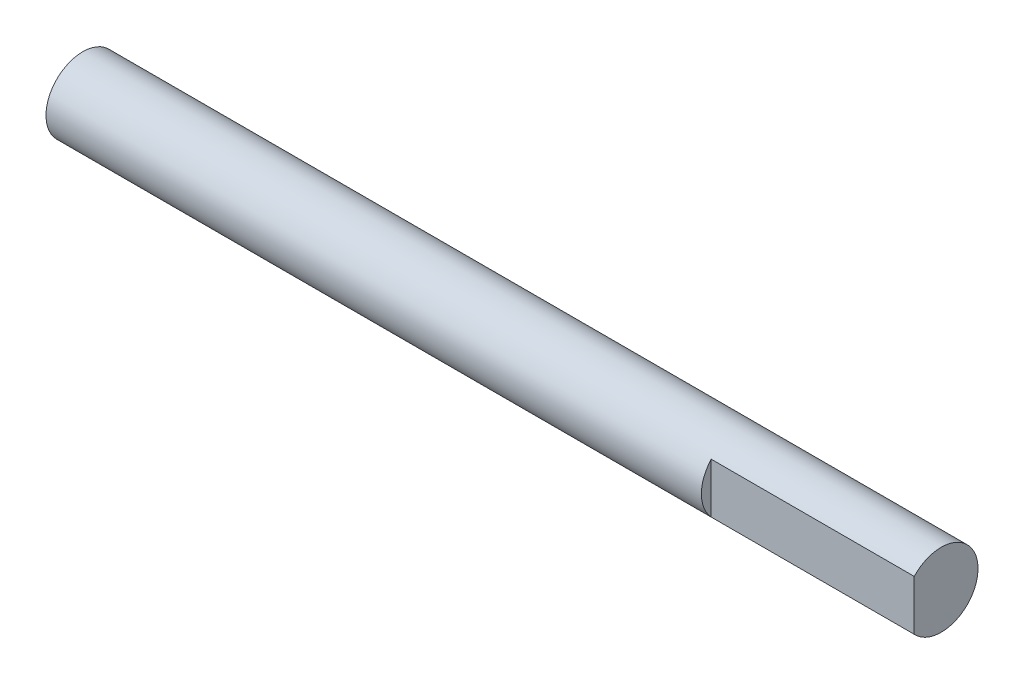
ISO-10303-21;
HEADER;
FILE_DESCRIPTION(('STEP AP214'),'2;1');
FILE_NAME('part.step','',(''),(''),'','','');
FILE_SCHEMA(('AUTOMOTIVE_DESIGN { 1 0 10303 214 1 1 1 1 }'));
ENDSEC;
DATA;
#1=APPLICATION_CONTEXT('core data for automotive mechanical design processes');
#2=APPLICATION_PROTOCOL_DEFINITION('international standard','automotive_design',2000,#1);
#3=PRODUCT_CONTEXT('',#1,'mechanical');
#4=PRODUCT('Part','Part','',(#3));
#5=PRODUCT_RELATED_PRODUCT_CATEGORY('part','',(#4));
#6=PRODUCT_DEFINITION_FORMATION('','',#4);
#7=PRODUCT_DEFINITION_CONTEXT('part definition',#1,'design');
#8=PRODUCT_DEFINITION('design','',#6,#7);
#9=PRODUCT_DEFINITION_SHAPE('','',#8);
#10=(LENGTH_UNIT() NAMED_UNIT(*) SI_UNIT(.MILLI.,.METRE.));
#11=(NAMED_UNIT(*) PLANE_ANGLE_UNIT() SI_UNIT($,.RADIAN.));
#12=(NAMED_UNIT(*) SI_UNIT($,.STERADIAN.) SOLID_ANGLE_UNIT());
#13=UNCERTAINTY_MEASURE_WITH_UNIT(LENGTH_MEASURE(1.E-05),#10,'distance_accuracy_value','');
#14=(GEOMETRIC_REPRESENTATION_CONTEXT(3) GLOBAL_UNCERTAINTY_ASSIGNED_CONTEXT((#13)) GLOBAL_UNIT_ASSIGNED_CONTEXT((#10,
#11,#12)) REPRESENTATION_CONTEXT('',''));
#15=CARTESIAN_POINT('',(0.,0.,0.));
#16=DIRECTION('',(0.,0.,1.));
#17=DIRECTION('',(1.,0.,0.));
#18=AXIS2_PLACEMENT_3D('',#15,#16,#17);
#19=CARTESIAN_POINT('',(-53.5,0.,0.));
#20=DIRECTION('',(-1.,0.,0.));
#21=DIRECTION('',(0.,0.,1.));
#22=AXIS2_PLACEMENT_3D('',#19,#20,#21);
#23=PLANE('',#22);
#24=CARTESIAN_POINT('',(-53.5,0.,0.));
#25=DIRECTION('',(-1.,0.,0.));
#26=DIRECTION('',(0.,-1.,0.));
#27=AXIS2_PLACEMENT_3D('',#24,#25,#26);
#28=CIRCLE('',#27,3.175);
#29=CARTESIAN_POINT('',(-53.5,3.175,0.));
#30=VERTEX_POINT('',#29);
#31=EDGE_CURVE('E10',#30,#30,#28,.T.);
#32=ORIENTED_EDGE('',*,*,#31,.T.);
#33=EDGE_LOOP('',(#32));
#34=FACE_BOUND('',#33,.T.);
#35=ADVANCED_FACE('F16',(#34),#23,.T.);
#36=CARTESIAN_POINT('',(-53.5,0.,0.));
#37=DIRECTION('',(1.,0.,0.));
#38=DIRECTION('',(0.,-1.,0.));
#39=AXIS2_PLACEMENT_3D('',#36,#37,#38);
#40=CYLINDRICAL_SURFACE('',#39,3.175);
#41=CARTESIAN_POINT('',(3.,0.,0.));
#42=DIRECTION('',(1.,0.,0.));
#43=DIRECTION('',(0.,-1.,0.));
#44=AXIS2_PLACEMENT_3D('',#41,#42,#43);
#45=CIRCLE('',#44,3.175);
#46=CARTESIAN_POINT('',(3.,2.16217483104396,2.325));
#47=VERTEX_POINT('',#46);
#48=CARTESIAN_POINT('',(3.,-2.16217483104396,2.325));
#49=VERTEX_POINT('',#48);
#50=EDGE_CURVE('E67',#47,#49,#45,.T.);
#51=ORIENTED_EDGE('',*,*,#50,.F.);
#52=DIRECTION('',(1.,0.,0.));
#53=VECTOR('',#52,1.);
#54=CARTESIAN_POINT('',(3.,2.16217483104396,2.325));
#55=LINE('',#54,#53);
#56=CARTESIAN_POINT('',(20.5,2.16217483104396,2.325));
#57=VERTEX_POINT('',#56);
#58=EDGE_CURVE('E70',#47,#57,#55,.T.);
#59=ORIENTED_EDGE('',*,*,#58,.T.);
#60=CARTESIAN_POINT('',(20.5,0.,0.));
#61=DIRECTION('',(1.,0.,0.));
#62=DIRECTION('',(0.,1.,0.));
#63=AXIS2_PLACEMENT_3D('',#60,#61,#62);
#64=CIRCLE('',#63,3.175);
#65=CARTESIAN_POINT('',(20.5,3.175,0.));
#66=VERTEX_POINT('',#65);
#67=EDGE_CURVE('E60',#66,#57,#64,.T.);
#68=ORIENTED_EDGE('',*,*,#67,.F.);
#69=DIRECTION('',(-1.,0.,0.));
#70=VECTOR('',#69,1.);
#71=CARTESIAN_POINT('',(-53.5,3.175,0.));
#72=LINE('',#71,#70);
#73=EDGE_CURVE('E27',#66,#30,#72,.T.);
#74=ORIENTED_EDGE('',*,*,#73,.T.);
#75=ORIENTED_EDGE('',*,*,#31,.F.);
#76=ORIENTED_EDGE('',*,*,#73,.F.);
#77=CARTESIAN_POINT('',(20.5,0.,0.));
#78=DIRECTION('',(1.,0.,0.));
#79=DIRECTION('',(0.,1.,0.));
#80=AXIS2_PLACEMENT_3D('',#77,#78,#79);
#81=CIRCLE('',#80,3.175);
#82=CARTESIAN_POINT('',(20.5,-2.16217483104396,2.325));
#83=VERTEX_POINT('',#82);
#84=EDGE_CURVE('E53',#83,#66,#81,.T.);
#85=ORIENTED_EDGE('',*,*,#84,.F.);
#86=DIRECTION('',(1.,0.,0.));
#87=VECTOR('',#86,1.);
#88=CARTESIAN_POINT('',(3.,-2.16217483104396,2.325));
#89=LINE('',#88,#87);
#90=EDGE_CURVE('E79',#49,#83,#89,.T.);
#91=ORIENTED_EDGE('',*,*,#90,.F.);
#92=EDGE_LOOP('',(#51,#59,#68,#74,#75,#76,#85,#91));
#93=FACE_BOUND('',#92,.T.);
#94=ADVANCED_FACE('F71',(#93),#40,.T.);
#95=CARTESIAN_POINT('',(3.,0.,0.));
#96=DIRECTION('',(-1.,0.,0.));
#97=DIRECTION('',(0.,0.,1.));
#98=AXIS2_PLACEMENT_3D('',#95,#96,#97);
#99=PLANE('',#98);
#100=DIRECTION('',(0.,1.,0.));
#101=VECTOR('',#100,1.);
#102=CARTESIAN_POINT('',(3.,1.08108741552198,2.325));
#103=LINE('',#102,#101);
#104=EDGE_CURVE('E20',#49,#47,#103,.T.);
#105=ORIENTED_EDGE('',*,*,#104,.T.);
#106=ORIENTED_EDGE('',*,*,#50,.T.);
#107=EDGE_LOOP('',(#105,#106));
#108=FACE_BOUND('',#107,.T.);
#109=ADVANCED_FACE('F96',(#108),#99,.F.);
#110=CARTESIAN_POINT('',(20.5,0.,-0.425));
#111=DIRECTION('',(1.,0.,0.));
#112=DIRECTION('',(0.,1.,0.));
#113=AXIS2_PLACEMENT_3D('',#110,#111,#112);
#114=PLANE('',#113);
#115=DIRECTION('',(0.,-1.,0.));
#116=VECTOR('',#115,1.);
#117=CARTESIAN_POINT('',(20.5,0.,2.325));
#118=LINE('',#117,#116);
#119=EDGE_CURVE('E63',#57,#83,#118,.T.);
#120=ORIENTED_EDGE('',*,*,#119,.T.);
#121=ORIENTED_EDGE('',*,*,#84,.T.);
#122=ORIENTED_EDGE('',*,*,#67,.T.);
#123=EDGE_LOOP('',(#120,#121,#122));
#124=FACE_BOUND('',#123,.T.);
#125=ADVANCED_FACE('F18',(#124),#114,.T.);
#126=CARTESIAN_POINT('',(3.,2.16217483104396,2.325));
#127=DIRECTION('',(0.,0.,1.));
#128=DIRECTION('',(1.,0.,0.));
#129=AXIS2_PLACEMENT_3D('',#126,#127,#128);
#130=PLANE('',#129);
#131=ORIENTED_EDGE('',*,*,#104,.F.);
#132=ORIENTED_EDGE('',*,*,#90,.T.);
#133=ORIENTED_EDGE('',*,*,#119,.F.);
#134=ORIENTED_EDGE('',*,*,#58,.F.);
#135=EDGE_LOOP('',(#131,#132,#133,#134));
#136=FACE_BOUND('',#135,.T.);
#137=ADVANCED_FACE('F78',(#136),#130,.T.);
#138=CLOSED_SHELL('',(#35,#94,#109,#125,#137));
#139=MANIFOLD_SOLID_BREP('B1',#138);
#140=ADVANCED_BREP_SHAPE_REPRESENTATION('',(#18,#139),#14);
#141=SHAPE_DEFINITION_REPRESENTATION(#9,#140);
ENDSEC;
END-ISO-10303-21;
